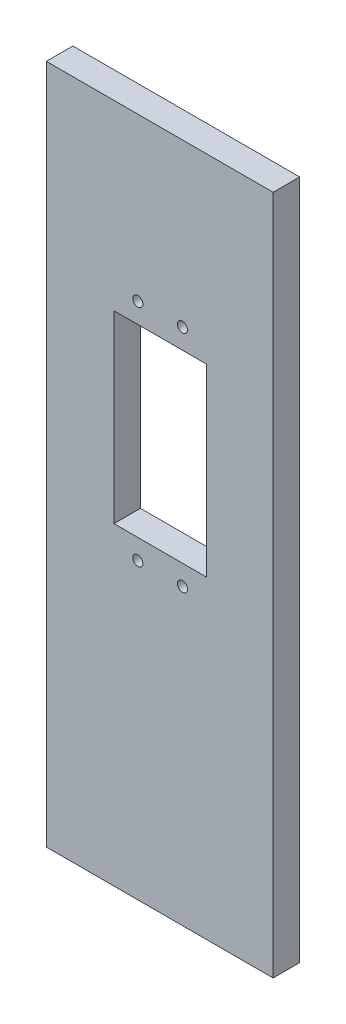
ISO-10303-21;
HEADER;
FILE_DESCRIPTION(('STEP AP214'),'2;1');
FILE_NAME('part.step','',(''),(''),'','','');
FILE_SCHEMA(('AUTOMOTIVE_DESIGN { 1 0 10303 214 1 1 1 1 }'));
ENDSEC;
DATA;
#1=APPLICATION_CONTEXT('core data for automotive mechanical design processes');
#2=APPLICATION_PROTOCOL_DEFINITION('international standard','automotive_design',2000,#1);
#3=PRODUCT_CONTEXT('',#1,'mechanical');
#4=PRODUCT('Part','Part','',(#3));
#5=PRODUCT_RELATED_PRODUCT_CATEGORY('part','',(#4));
#6=PRODUCT_DEFINITION_FORMATION('','',#4);
#7=PRODUCT_DEFINITION_CONTEXT('part definition',#1,'design');
#8=PRODUCT_DEFINITION('design','',#6,#7);
#9=PRODUCT_DEFINITION_SHAPE('','',#8);
#10=(LENGTH_UNIT() NAMED_UNIT(*) SI_UNIT(.MILLI.,.METRE.));
#11=(NAMED_UNIT(*) PLANE_ANGLE_UNIT() SI_UNIT($,.RADIAN.));
#12=(NAMED_UNIT(*) SI_UNIT($,.STERADIAN.) SOLID_ANGLE_UNIT());
#13=UNCERTAINTY_MEASURE_WITH_UNIT(LENGTH_MEASURE(1.E-05),#10,'distance_accuracy_value','');
#14=(GEOMETRIC_REPRESENTATION_CONTEXT(3) GLOBAL_UNCERTAINTY_ASSIGNED_CONTEXT((#13)) GLOBAL_UNIT_ASSIGNED_CONTEXT((#10,
#11,#12)) REPRESENTATION_CONTEXT('',''));
#15=CARTESIAN_POINT('',(0.,0.,0.));
#16=DIRECTION('',(0.,0.,1.));
#17=DIRECTION('',(1.,0.,0.));
#18=AXIS2_PLACEMENT_3D('',#15,#16,#17);
#19=CARTESIAN_POINT('',(0.,0.,5.9436));
#20=DIRECTION('',(1.,0.,0.));
#21=DIRECTION('',(0.,0.,-1.));
#22=AXIS2_PLACEMENT_3D('',#19,#20,#21);
#23=PLANE('',#22);
#24=DIRECTION('',(0.,-1.,0.));
#25=VECTOR('',#24,1.);
#26=CARTESIAN_POINT('',(0.,0.,0.));
#27=LINE('',#26,#25);
#28=CARTESIAN_POINT('',(0.,152.4,0.));
#29=VERTEX_POINT('',#28);
#30=CARTESIAN_POINT('',(0.,0.,0.));
#31=VERTEX_POINT('',#30);
#32=EDGE_CURVE('E134',#29,#31,#27,.T.);
#33=ORIENTED_EDGE('',*,*,#32,.T.);
#34=DIRECTION('',(0.,0.,-1.));
#35=VECTOR('',#34,1.);
#36=CARTESIAN_POINT('',(0.,0.,5.9436));
#37=LINE('',#36,#35);
#38=CARTESIAN_POINT('',(0.,0.,5.9436));
#39=VERTEX_POINT('',#38);
#40=EDGE_CURVE('E11',#39,#31,#37,.T.);
#41=ORIENTED_EDGE('',*,*,#40,.F.);
#42=DIRECTION('',(0.,-1.,0.));
#43=VECTOR('',#42,1.);
#44=CARTESIAN_POINT('',(0.,0.,5.9436));
#45=LINE('',#44,#43);
#46=CARTESIAN_POINT('',(0.,152.4,5.9436));
#47=VERTEX_POINT('',#46);
#48=EDGE_CURVE('E138',#47,#39,#45,.T.);
#49=ORIENTED_EDGE('',*,*,#48,.F.);
#50=DIRECTION('',(0.,0.,-1.));
#51=VECTOR('',#50,1.);
#52=CARTESIAN_POINT('',(0.,152.4,5.9436));
#53=LINE('',#52,#51);
#54=EDGE_CURVE('E148',#47,#29,#53,.T.);
#55=ORIENTED_EDGE('',*,*,#54,.T.);
#56=EDGE_LOOP('',(#33,#41,#49,#55));
#57=FACE_BOUND('',#56,.T.);
#58=ADVANCED_FACE('F33',(#57),#23,.F.);
#59=CARTESIAN_POINT('',(0.,0.,5.9436));
#60=DIRECTION('',(0.,1.,0.));
#61=DIRECTION('',(0.,0.,1.));
#62=AXIS2_PLACEMENT_3D('',#59,#60,#61);
#63=PLANE('',#62);
#64=DIRECTION('',(1.,0.,0.));
#65=VECTOR('',#64,1.);
#66=CARTESIAN_POINT('',(0.,0.,0.));
#67=LINE('',#66,#65);
#68=CARTESIAN_POINT('',(50.8,0.,0.));
#69=VERTEX_POINT('',#68);
#70=EDGE_CURVE('E151',#31,#69,#67,.T.);
#71=ORIENTED_EDGE('',*,*,#70,.T.);
#72=DIRECTION('',(0.,0.,-1.));
#73=VECTOR('',#72,1.);
#74=CARTESIAN_POINT('',(50.8,0.,5.9436));
#75=LINE('',#74,#73);
#76=CARTESIAN_POINT('',(50.8,0.,5.9436));
#77=VERTEX_POINT('',#76);
#78=EDGE_CURVE('E40',#77,#69,#75,.T.);
#79=ORIENTED_EDGE('',*,*,#78,.F.);
#80=DIRECTION('',(1.,0.,0.));
#81=VECTOR('',#80,1.);
#82=CARTESIAN_POINT('',(0.,0.,5.9436));
#83=LINE('',#82,#81);
#84=EDGE_CURVE('E141',#39,#77,#83,.T.);
#85=ORIENTED_EDGE('',*,*,#84,.F.);
#86=ORIENTED_EDGE('',*,*,#40,.T.);
#87=EDGE_LOOP('',(#71,#79,#85,#86));
#88=FACE_BOUND('',#87,.T.);
#89=ADVANCED_FACE('F179',(#88),#63,.F.);
#90=CARTESIAN_POINT('',(50.8,0.,5.9436));
#91=DIRECTION('',(-1.,0.,0.));
#92=DIRECTION('',(0.,0.,1.));
#93=AXIS2_PLACEMENT_3D('',#90,#91,#92);
#94=PLANE('',#93);
#95=DIRECTION('',(0.,1.,0.));
#96=VECTOR('',#95,1.);
#97=CARTESIAN_POINT('',(50.8,0.,0.));
#98=LINE('',#97,#96);
#99=CARTESIAN_POINT('',(50.8,152.4,0.));
#100=VERTEX_POINT('',#99);
#101=EDGE_CURVE('E153',#69,#100,#98,.T.);
#102=ORIENTED_EDGE('',*,*,#101,.T.);
#103=DIRECTION('',(0.,0.,-1.));
#104=VECTOR('',#103,1.);
#105=CARTESIAN_POINT('',(50.8,152.4,5.9436));
#106=LINE('',#105,#104);
#107=CARTESIAN_POINT('',(50.8,152.4,5.9436));
#108=VERTEX_POINT('',#107);
#109=EDGE_CURVE('E158',#108,#100,#106,.T.);
#110=ORIENTED_EDGE('',*,*,#109,.F.);
#111=DIRECTION('',(0.,1.,0.));
#112=VECTOR('',#111,1.);
#113=CARTESIAN_POINT('',(50.8,0.,5.9436));
#114=LINE('',#113,#112);
#115=EDGE_CURVE('E144',#77,#108,#114,.T.);
#116=ORIENTED_EDGE('',*,*,#115,.F.);
#117=ORIENTED_EDGE('',*,*,#78,.T.);
#118=EDGE_LOOP('',(#102,#110,#116,#117));
#119=FACE_BOUND('',#118,.T.);
#120=ADVANCED_FACE('F165',(#119),#94,.F.);
#121=CARTESIAN_POINT('',(0.,152.4,5.9436));
#122=DIRECTION('',(0.,-1.,0.));
#123=DIRECTION('',(0.,0.,-1.));
#124=AXIS2_PLACEMENT_3D('',#121,#122,#123);
#125=PLANE('',#124);
#126=DIRECTION('',(-1.,0.,0.));
#127=VECTOR('',#126,1.);
#128=CARTESIAN_POINT('',(0.,152.4,0.));
#129=LINE('',#128,#127);
#130=EDGE_CURVE('E142',#100,#29,#129,.T.);
#131=ORIENTED_EDGE('',*,*,#130,.T.);
#132=ORIENTED_EDGE('',*,*,#54,.F.);
#133=DIRECTION('',(-1.,0.,0.));
#134=VECTOR('',#133,1.);
#135=CARTESIAN_POINT('',(0.,152.4,5.9436));
#136=LINE('',#135,#134);
#137=EDGE_CURVE('E146',#108,#47,#136,.T.);
#138=ORIENTED_EDGE('',*,*,#137,.F.);
#139=ORIENTED_EDGE('',*,*,#109,.T.);
#140=EDGE_LOOP('',(#131,#132,#138,#139));
#141=FACE_BOUND('',#140,.T.);
#142=ADVANCED_FACE('F172',(#141),#125,.F.);
#143=CARTESIAN_POINT('',(0.,0.,5.9436));
#144=DIRECTION('',(0.,0.,-1.));
#145=DIRECTION('',(-1.,0.,0.));
#146=AXIS2_PLACEMENT_3D('',#143,#144,#145);
#147=PLANE('',#146);
#148=CARTESIAN_POINT('',(30.4921313464654,65.8,5.9436));
#149=DIRECTION('',(0.,0.,1.));
#150=DIRECTION('',(1.,0.,0.));
#151=AXIS2_PLACEMENT_3D('',#148,#149,#150);
#152=CIRCLE('',#151,1.1303);
#153=CARTESIAN_POINT('',(31.6224313464654,65.8,5.9436));
#154=VERTEX_POINT('',#153);
#155=EDGE_CURVE('E121',#154,#154,#152,.T.);
#156=ORIENTED_EDGE('',*,*,#155,.F.);
#157=EDGE_LOOP('',(#156));
#158=FACE_BOUND('',#157,.T.);
#159=CARTESIAN_POINT('',(20.4921313464654,65.8,5.9436));
#160=DIRECTION('',(0.,0.,1.));
#161=DIRECTION('',(1.,0.,0.));
#162=AXIS2_PLACEMENT_3D('',#159,#160,#161);
#163=CIRCLE('',#162,1.1303);
#164=CARTESIAN_POINT('',(21.6224313464654,65.8,5.9436));
#165=VERTEX_POINT('',#164);
#166=EDGE_CURVE('E242',#165,#165,#163,.T.);
#167=ORIENTED_EDGE('',*,*,#166,.F.);
#168=EDGE_LOOP('',(#167));
#169=FACE_BOUND('',#168,.T.);
#170=CARTESIAN_POINT('',(30.4921313464654,116.1,5.9436));
#171=DIRECTION('',(0.,0.,1.));
#172=DIRECTION('',(1.,0.,0.));
#173=AXIS2_PLACEMENT_3D('',#170,#171,#172);
#174=CIRCLE('',#173,1.1303);
#175=CARTESIAN_POINT('',(31.6224313464654,116.1,5.9436));
#176=VERTEX_POINT('',#175);
#177=EDGE_CURVE('E234',#176,#176,#174,.T.);
#178=ORIENTED_EDGE('',*,*,#177,.F.);
#179=EDGE_LOOP('',(#178));
#180=FACE_BOUND('',#179,.T.);
#181=CARTESIAN_POINT('',(20.4921313464654,116.1,5.9436));
#182=DIRECTION('',(0.,0.,1.));
#183=DIRECTION('',(1.,0.,0.));
#184=AXIS2_PLACEMENT_3D('',#181,#182,#183);
#185=CIRCLE('',#184,1.1303);
#186=CARTESIAN_POINT('',(21.6224313464654,116.1,5.9436));
#187=VERTEX_POINT('',#186);
#188=EDGE_CURVE('E228',#187,#187,#185,.T.);
#189=ORIENTED_EDGE('',*,*,#188,.F.);
#190=EDGE_LOOP('',(#189));
#191=FACE_BOUND('',#190,.T.);
#192=DIRECTION('',(1.,0.,0.));
#193=VECTOR('',#192,1.);
#194=CARTESIAN_POINT('',(15.1421313464654,70.2999999999999,5.9436));
#195=LINE('',#194,#193);
#196=CARTESIAN_POINT('',(15.1421313464654,70.2999999999999,5.9436));
#197=VERTEX_POINT('',#196);
#198=CARTESIAN_POINT('',(35.8421313464654,70.2999999999999,5.9436));
#199=VERTEX_POINT('',#198);
#200=EDGE_CURVE('E127',#197,#199,#195,.T.);
#201=ORIENTED_EDGE('',*,*,#200,.F.);
#202=DIRECTION('',(0.,-1.,0.));
#203=VECTOR('',#202,1.);
#204=CARTESIAN_POINT('',(15.1421313464654,111.6,5.9436));
#205=LINE('',#204,#203);
#206=CARTESIAN_POINT('',(15.1421313464654,111.6,5.9436));
#207=VERTEX_POINT('',#206);
#208=EDGE_CURVE('E47',#207,#197,#205,.T.);
#209=ORIENTED_EDGE('',*,*,#208,.F.);
#210=DIRECTION('',(-1.,0.,0.));
#211=VECTOR('',#210,1.);
#212=CARTESIAN_POINT('',(15.1421313464654,111.6,5.9436));
#213=LINE('',#212,#211);
#214=CARTESIAN_POINT('',(35.8421313464654,111.6,5.9436));
#215=VERTEX_POINT('',#214);
#216=EDGE_CURVE('E115',#215,#207,#213,.T.);
#217=ORIENTED_EDGE('',*,*,#216,.F.);
#218=DIRECTION('',(0.,1.,0.));
#219=VECTOR('',#218,1.);
#220=CARTESIAN_POINT('',(35.8421313464654,111.6,5.9436));
#221=LINE('',#220,#219);
#222=EDGE_CURVE('E118',#199,#215,#221,.T.);
#223=ORIENTED_EDGE('',*,*,#222,.F.);
#224=EDGE_LOOP('',(#201,#209,#217,#223));
#225=FACE_BOUND('',#224,.T.);
#226=ORIENTED_EDGE('',*,*,#48,.T.);
#227=ORIENTED_EDGE('',*,*,#84,.T.);
#228=ORIENTED_EDGE('',*,*,#115,.T.);
#229=ORIENTED_EDGE('',*,*,#137,.T.);
#230=EDGE_LOOP('',(#226,#227,#228,#229));
#231=FACE_BOUND('',#230,.T.);
#232=ADVANCED_FACE('F178',(#158,#169,#180,#191,#225,#231),#147,.F.);
#233=CARTESIAN_POINT('',(0.,0.,0.));
#234=DIRECTION('',(0.,0.,-1.));
#235=DIRECTION('',(-1.,0.,0.));
#236=AXIS2_PLACEMENT_3D('',#233,#234,#235);
#237=PLANE('',#236);
#238=CARTESIAN_POINT('',(30.4921313464654,65.8,0.));
#239=DIRECTION('',(0.,0.,1.));
#240=DIRECTION('',(1.,0.,0.));
#241=AXIS2_PLACEMENT_3D('',#238,#239,#240);
#242=CIRCLE('',#241,1.1303);
#243=CARTESIAN_POINT('',(31.6224313464654,65.8,0.));
#244=VERTEX_POINT('',#243);
#245=EDGE_CURVE('E244',#244,#244,#242,.T.);
#246=ORIENTED_EDGE('',*,*,#245,.T.);
#247=EDGE_LOOP('',(#246));
#248=FACE_BOUND('',#247,.T.);
#249=CARTESIAN_POINT('',(20.4921313464654,65.8,0.));
#250=DIRECTION('',(0.,0.,1.));
#251=DIRECTION('',(1.,0.,0.));
#252=AXIS2_PLACEMENT_3D('',#249,#250,#251);
#253=CIRCLE('',#252,1.1303);
#254=CARTESIAN_POINT('',(21.6224313464654,65.8,0.));
#255=VERTEX_POINT('',#254);
#256=EDGE_CURVE('E239',#255,#255,#253,.T.);
#257=ORIENTED_EDGE('',*,*,#256,.T.);
#258=EDGE_LOOP('',(#257));
#259=FACE_BOUND('',#258,.T.);
#260=CARTESIAN_POINT('',(30.4921313464654,116.1,0.));
#261=DIRECTION('',(0.,0.,1.));
#262=DIRECTION('',(1.,0.,0.));
#263=AXIS2_PLACEMENT_3D('',#260,#261,#262);
#264=CIRCLE('',#263,1.1303);
#265=CARTESIAN_POINT('',(31.6224313464654,116.1,0.));
#266=VERTEX_POINT('',#265);
#267=EDGE_CURVE('E230',#266,#266,#264,.T.);
#268=ORIENTED_EDGE('',*,*,#267,.T.);
#269=EDGE_LOOP('',(#268));
#270=FACE_BOUND('',#269,.T.);
#271=CARTESIAN_POINT('',(20.4921313464654,116.1,0.));
#272=DIRECTION('',(0.,0.,1.));
#273=DIRECTION('',(1.,0.,0.));
#274=AXIS2_PLACEMENT_3D('',#271,#272,#273);
#275=CIRCLE('',#274,1.1303);
#276=CARTESIAN_POINT('',(21.6224313464654,116.1,0.));
#277=VERTEX_POINT('',#276);
#278=EDGE_CURVE('E128',#277,#277,#275,.T.);
#279=ORIENTED_EDGE('',*,*,#278,.T.);
#280=EDGE_LOOP('',(#279));
#281=FACE_BOUND('',#280,.T.);
#282=DIRECTION('',(0.,-1.,0.));
#283=VECTOR('',#282,1.);
#284=CARTESIAN_POINT('',(15.1421313464654,111.6,0.));
#285=LINE('',#284,#283);
#286=CARTESIAN_POINT('',(15.1421313464654,111.6,0.));
#287=VERTEX_POINT('',#286);
#288=CARTESIAN_POINT('',(15.1421313464654,70.2999999999999,0.));
#289=VERTEX_POINT('',#288);
#290=EDGE_CURVE('E99',#287,#289,#285,.T.);
#291=ORIENTED_EDGE('',*,*,#290,.T.);
#292=DIRECTION('',(1.,0.,0.));
#293=VECTOR('',#292,1.);
#294=CARTESIAN_POINT('',(15.1421313464654,70.2999999999999,0.));
#295=LINE('',#294,#293);
#296=CARTESIAN_POINT('',(35.8421313464654,70.2999999999999,0.));
#297=VERTEX_POINT('',#296);
#298=EDGE_CURVE('E108',#289,#297,#295,.T.);
#299=ORIENTED_EDGE('',*,*,#298,.T.);
#300=DIRECTION('',(0.,1.,0.));
#301=VECTOR('',#300,1.);
#302=CARTESIAN_POINT('',(35.8421313464654,111.6,0.));
#303=LINE('',#302,#301);
#304=CARTESIAN_POINT('',(35.8421313464654,111.6,0.));
#305=VERTEX_POINT('',#304);
#306=EDGE_CURVE('E55',#297,#305,#303,.T.);
#307=ORIENTED_EDGE('',*,*,#306,.T.);
#308=DIRECTION('',(-1.,0.,0.));
#309=VECTOR('',#308,1.);
#310=CARTESIAN_POINT('',(15.1421313464654,111.6,0.));
#311=LINE('',#310,#309);
#312=EDGE_CURVE('E105',#305,#287,#311,.T.);
#313=ORIENTED_EDGE('',*,*,#312,.T.);
#314=EDGE_LOOP('',(#291,#299,#307,#313));
#315=FACE_BOUND('',#314,.T.);
#316=ORIENTED_EDGE('',*,*,#32,.F.);
#317=ORIENTED_EDGE('',*,*,#130,.F.);
#318=ORIENTED_EDGE('',*,*,#101,.F.);
#319=ORIENTED_EDGE('',*,*,#70,.F.);
#320=EDGE_LOOP('',(#316,#317,#318,#319));
#321=FACE_BOUND('',#320,.T.);
#322=ADVANCED_FACE('F112',(#248,#259,#270,#281,#315,#321),#237,.T.);
#323=CARTESIAN_POINT('',(15.1421313464654,111.6,0.));
#324=DIRECTION('',(-1.,0.,0.));
#325=DIRECTION('',(0.,-1.,0.));
#326=AXIS2_PLACEMENT_3D('',#323,#324,#325);
#327=PLANE('',#326);
#328=ORIENTED_EDGE('',*,*,#208,.T.);
#329=DIRECTION('',(0.,0.,1.));
#330=VECTOR('',#329,1.);
#331=CARTESIAN_POINT('',(15.1421313464654,70.2999999999999,0.));
#332=LINE('',#331,#330);
#333=EDGE_CURVE('E95',#289,#197,#332,.T.);
#334=ORIENTED_EDGE('',*,*,#333,.F.);
#335=ORIENTED_EDGE('',*,*,#290,.F.);
#336=DIRECTION('',(0.,0.,1.));
#337=VECTOR('',#336,1.);
#338=CARTESIAN_POINT('',(15.1421313464654,111.6,0.));
#339=LINE('',#338,#337);
#340=EDGE_CURVE('E132',#287,#207,#339,.T.);
#341=ORIENTED_EDGE('',*,*,#340,.T.);
#342=EDGE_LOOP('',(#328,#334,#335,#341));
#343=FACE_BOUND('',#342,.T.);
#344=ADVANCED_FACE('F97',(#343),#327,.F.);
#345=CARTESIAN_POINT('',(15.1421313464654,111.6,0.));
#346=DIRECTION('',(0.,1.,0.));
#347=DIRECTION('',(0.,0.,1.));
#348=AXIS2_PLACEMENT_3D('',#345,#346,#347);
#349=PLANE('',#348);
#350=ORIENTED_EDGE('',*,*,#216,.T.);
#351=ORIENTED_EDGE('',*,*,#340,.F.);
#352=ORIENTED_EDGE('',*,*,#312,.F.);
#353=DIRECTION('',(0.,0.,1.));
#354=VECTOR('',#353,1.);
#355=CARTESIAN_POINT('',(35.8421313464654,111.6,0.));
#356=LINE('',#355,#354);
#357=EDGE_CURVE('E135',#305,#215,#356,.T.);
#358=ORIENTED_EDGE('',*,*,#357,.T.);
#359=EDGE_LOOP('',(#350,#351,#352,#358));
#360=FACE_BOUND('',#359,.T.);
#361=ADVANCED_FACE('F197',(#360),#349,.F.);
#362=CARTESIAN_POINT('',(35.8421313464654,111.6,0.));
#363=DIRECTION('',(1.,0.,0.));
#364=DIRECTION('',(0.,1.,0.));
#365=AXIS2_PLACEMENT_3D('',#362,#363,#364);
#366=PLANE('',#365);
#367=ORIENTED_EDGE('',*,*,#222,.T.);
#368=ORIENTED_EDGE('',*,*,#357,.F.);
#369=ORIENTED_EDGE('',*,*,#306,.F.);
#370=DIRECTION('',(0.,0.,1.));
#371=VECTOR('',#370,1.);
#372=CARTESIAN_POINT('',(35.8421313464654,70.2999999999999,0.));
#373=LINE('',#372,#371);
#374=EDGE_CURVE('E104',#297,#199,#373,.T.);
#375=ORIENTED_EDGE('',*,*,#374,.T.);
#376=EDGE_LOOP('',(#367,#368,#369,#375));
#377=FACE_BOUND('',#376,.T.);
#378=ADVANCED_FACE('F201',(#377),#366,.F.);
#379=CARTESIAN_POINT('',(15.1421313464654,70.2999999999999,0.));
#380=DIRECTION('',(0.,-1.,0.));
#381=DIRECTION('',(0.,0.,-1.));
#382=AXIS2_PLACEMENT_3D('',#379,#380,#381);
#383=PLANE('',#382);
#384=ORIENTED_EDGE('',*,*,#200,.T.);
#385=ORIENTED_EDGE('',*,*,#374,.F.);
#386=ORIENTED_EDGE('',*,*,#298,.F.);
#387=ORIENTED_EDGE('',*,*,#333,.T.);
#388=EDGE_LOOP('',(#384,#385,#386,#387));
#389=FACE_BOUND('',#388,.T.);
#390=ADVANCED_FACE('F109',(#389),#383,.F.);
#391=CARTESIAN_POINT('',(20.4921313464654,116.1,0.));
#392=DIRECTION('',(0.,0.,1.));
#393=DIRECTION('',(1.,0.,0.));
#394=AXIS2_PLACEMENT_3D('',#391,#392,#393);
#395=CYLINDRICAL_SURFACE('',#394,1.1303);
#396=ORIENTED_EDGE('',*,*,#278,.F.);
#397=EDGE_LOOP('',(#396));
#398=FACE_BOUND('',#397,.T.);
#399=ORIENTED_EDGE('',*,*,#188,.T.);
#400=EDGE_LOOP('',(#399));
#401=FACE_BOUND('',#400,.T.);
#402=ADVANCED_FACE('F200',(#398,#401),#395,.F.);
#403=CARTESIAN_POINT('',(30.4921313464654,116.1,0.));
#404=DIRECTION('',(0.,0.,1.));
#405=DIRECTION('',(1.,0.,0.));
#406=AXIS2_PLACEMENT_3D('',#403,#404,#405);
#407=CYLINDRICAL_SURFACE('',#406,1.1303);
#408=ORIENTED_EDGE('',*,*,#267,.F.);
#409=EDGE_LOOP('',(#408));
#410=FACE_BOUND('',#409,.T.);
#411=ORIENTED_EDGE('',*,*,#177,.T.);
#412=EDGE_LOOP('',(#411));
#413=FACE_BOUND('',#412,.T.);
#414=ADVANCED_FACE('F214',(#410,#413),#407,.F.);
#415=CARTESIAN_POINT('',(20.4921313464654,65.8,0.));
#416=DIRECTION('',(0.,0.,1.));
#417=DIRECTION('',(1.,0.,0.));
#418=AXIS2_PLACEMENT_3D('',#415,#416,#417);
#419=CYLINDRICAL_SURFACE('',#418,1.1303);
#420=ORIENTED_EDGE('',*,*,#256,.F.);
#421=EDGE_LOOP('',(#420));
#422=FACE_BOUND('',#421,.T.);
#423=ORIENTED_EDGE('',*,*,#166,.T.);
#424=EDGE_LOOP('',(#423));
#425=FACE_BOUND('',#424,.T.);
#426=ADVANCED_FACE('F210',(#422,#425),#419,.F.);
#427=CARTESIAN_POINT('',(30.4921313464654,65.8,0.));
#428=DIRECTION('',(0.,0.,1.));
#429=DIRECTION('',(1.,0.,0.));
#430=AXIS2_PLACEMENT_3D('',#427,#428,#429);
#431=CYLINDRICAL_SURFACE('',#430,1.1303);
#432=ORIENTED_EDGE('',*,*,#245,.F.);
#433=EDGE_LOOP('',(#432));
#434=FACE_BOUND('',#433,.T.);
#435=ORIENTED_EDGE('',*,*,#155,.T.);
#436=EDGE_LOOP('',(#435));
#437=FACE_BOUND('',#436,.T.);
#438=ADVANCED_FACE('F207',(#434,#437),#431,.F.);
#439=CLOSED_SHELL('',(#58,#89,#120,#142,#232,#322,#344,#361,#378,#390,#402,#414,#426,#438));
#440=MANIFOLD_SOLID_BREP('B2',#439);
#441=ADVANCED_BREP_SHAPE_REPRESENTATION('',(#18,#440),#14);
#442=SHAPE_DEFINITION_REPRESENTATION(#9,#441);
ENDSEC;
END-ISO-10303-21;
